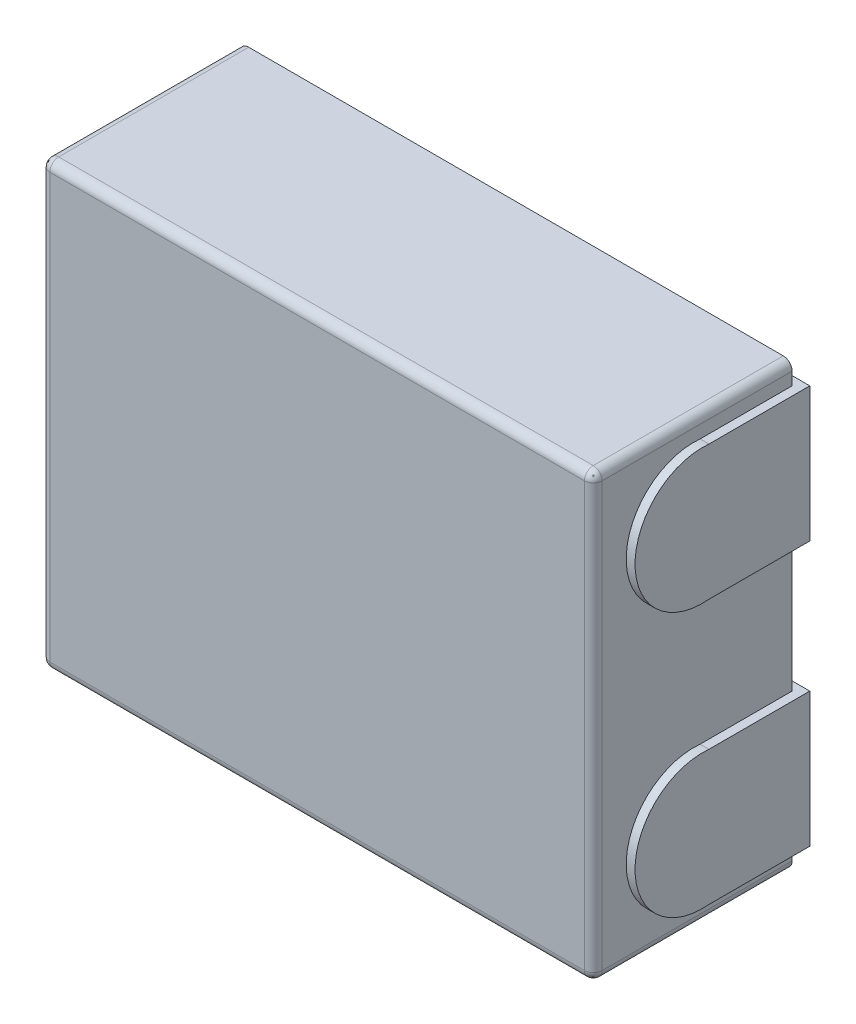
ISO-10303-21;
HEADER;
FILE_DESCRIPTION(('STEP AP214'),'2;1');
FILE_NAME('part.step','',(''),(''),'','','');
FILE_SCHEMA(('AUTOMOTIVE_DESIGN { 1 0 10303 214 1 1 1 1 }'));
ENDSEC;
DATA;
#1=APPLICATION_CONTEXT('core data for automotive mechanical design processes');
#2=APPLICATION_PROTOCOL_DEFINITION('international standard','automotive_design',2000,#1);
#3=PRODUCT_CONTEXT('',#1,'mechanical');
#4=PRODUCT('Part','Part','',(#3));
#5=PRODUCT_RELATED_PRODUCT_CATEGORY('part','',(#4));
#6=PRODUCT_DEFINITION_FORMATION('','',#4);
#7=PRODUCT_DEFINITION_CONTEXT('part definition',#1,'design');
#8=PRODUCT_DEFINITION('design','',#6,#7);
#9=PRODUCT_DEFINITION_SHAPE('','',#8);
#10=(LENGTH_UNIT() NAMED_UNIT(*) SI_UNIT(.MILLI.,.METRE.));
#11=(NAMED_UNIT(*) PLANE_ANGLE_UNIT() SI_UNIT($,.RADIAN.));
#12=(NAMED_UNIT(*) SI_UNIT($,.STERADIAN.) SOLID_ANGLE_UNIT());
#13=UNCERTAINTY_MEASURE_WITH_UNIT(LENGTH_MEASURE(1.E-05),#10,'distance_accuracy_value','');
#14=(GEOMETRIC_REPRESENTATION_CONTEXT(3) GLOBAL_UNCERTAINTY_ASSIGNED_CONTEXT((#13)) GLOBAL_UNIT_ASSIGNED_CONTEXT((#10,
#11,#12)) REPRESENTATION_CONTEXT('',''));
#15=CARTESIAN_POINT('',(0.,0.,0.));
#16=DIRECTION('',(0.,0.,1.));
#17=DIRECTION('',(1.,0.,0.));
#18=AXIS2_PLACEMENT_3D('',#15,#16,#17);
#19=CARTESIAN_POINT('',(-3.01252459766994,-0.304168853033011,-0.0199999999999996));
#20=DIRECTION('',(0.,0.,1.));
#21=DIRECTION('',(1.,0.,0.));
#22=AXIS2_PLACEMENT_3D('',#19,#20,#21);
#23=PLANE('',#22);
#24=DIRECTION('',(1.,0.,0.));
#25=VECTOR('',#24,1.);
#26=CARTESIAN_POINT('',(-3.01252459766994,-0.304168853033011,-0.0199999999999996));
#27=LINE('',#26,#25);
#28=CARTESIAN_POINT('',(-3.01252459766994,-0.304168853033011,-0.0199999999999996));
#29=VERTEX_POINT('',#28);
#30=CARTESIAN_POINT('',(-3.31252459766994,-0.304168853033011,-0.0199999999999996));
#31=VERTEX_POINT('',#30);
#32=EDGE_CURVE('P0_E54',#29,#31,#27,.F.);
#33=ORIENTED_EDGE('',*,*,#32,.T.);
#34=DIRECTION('',(0.,1.,0.));
#35=VECTOR('',#34,1.);
#36=CARTESIAN_POINT('',(-3.31252459766994,-0.152084426516506,-0.0199999999999997));
#37=LINE('',#36,#35);
#38=CARTESIAN_POINT('',(-3.31252459766994,0.,-0.0199999999999997));
#39=VERTEX_POINT('',#38);
#40=EDGE_CURVE('P0_E64',#39,#31,#37,.F.);
#41=ORIENTED_EDGE('',*,*,#40,.F.);
#42=DIRECTION('',(1.,0.,0.));
#43=VECTOR('',#42,1.);
#44=CARTESIAN_POINT('',(-3.01252459766994,0.,-0.0199999999999997));
#45=LINE('',#44,#43);
#46=CARTESIAN_POINT('',(-3.01252459766994,0.,-0.0199999999999997));
#47=VERTEX_POINT('',#46);
#48=EDGE_CURVE('P0_E61',#39,#47,#45,.T.);
#49=ORIENTED_EDGE('',*,*,#48,.T.);
#50=DIRECTION('',(0.,1.,0.));
#51=VECTOR('',#50,1.);
#52=CARTESIAN_POINT('',(-3.01252459766994,-0.152084426516506,-0.0199999999999996));
#53=LINE('',#52,#51);
#54=EDGE_CURVE('P0_E63',#47,#29,#53,.F.);
#55=ORIENTED_EDGE('',*,*,#54,.T.);
#56=EDGE_LOOP('',(#33,#41,#49,#55));
#57=FACE_BOUND('',#56,.T.);
#58=ADVANCED_FACE('P0_F16',(#57),#23,.F.);
#59=CARTESIAN_POINT('',(-3.01252459766994,-0.152084426516506,0.137210257429789));
#60=DIRECTION('',(-1.,0.,0.));
#61=DIRECTION('',(0.,0.,1.));
#62=AXIS2_PLACEMENT_3D('',#59,#60,#61);
#63=PLANE('',#62);
#64=DIRECTION('',(0.,0.,-1.));
#65=VECTOR('',#64,1.);
#66=CARTESIAN_POINT('',(-3.01252459766994,0.,-0.0199999999999996));
#67=LINE('',#66,#65);
#68=CARTESIAN_POINT('',(-3.01252459766994,0.,0.208056510436575));
#69=VERTEX_POINT('',#68);
#70=EDGE_CURVE('P0_E68',#47,#69,#67,.F.);
#71=ORIENTED_EDGE('',*,*,#70,.T.);
#72=CARTESIAN_POINT('',(-3.01252459766994,-0.152084426516506,0.222703998621652));
#73=DIRECTION('',(1.,0.,0.));
#74=DIRECTION('',(0.,0.,-1.));
#75=AXIS2_PLACEMENT_3D('',#72,#73,#74);
#76=CIRCLE('',#75,0.152788159551015);
#77=CARTESIAN_POINT('',(-3.01252459766994,-0.304168853033011,0.208056510436569));
#78=VERTEX_POINT('',#77);
#79=EDGE_CURVE('P0_E19',#78,#69,#76,.F.);
#80=ORIENTED_EDGE('',*,*,#79,.F.);
#81=DIRECTION('',(0.,0.,1.));
#82=VECTOR('',#81,1.);
#83=CARTESIAN_POINT('',(-3.01252459766994,-0.304168853033011,0.208056510436572));
#84=LINE('',#83,#82);
#85=EDGE_CURVE('P0_E72',#78,#29,#84,.F.);
#86=ORIENTED_EDGE('',*,*,#85,.T.);
#87=ORIENTED_EDGE('',*,*,#54,.F.);
#88=EDGE_LOOP('',(#71,#80,#86,#87));
#89=FACE_BOUND('',#88,.T.);
#90=ADVANCED_FACE('P0_F70',(#89),#63,.F.);
#91=CARTESIAN_POINT('',(-3.01252459766994,0.,-0.0199999999999996));
#92=DIRECTION('',(0.,-1.,0.));
#93=DIRECTION('',(0.,0.,-1.));
#94=AXIS2_PLACEMENT_3D('',#91,#92,#93);
#95=PLANE('',#94);
#96=ORIENTED_EDGE('',*,*,#48,.F.);
#97=DIRECTION('',(0.,0.,1.));
#98=VECTOR('',#97,1.);
#99=CARTESIAN_POINT('',(-3.31252459766994,0.,0.137210257429789));
#100=LINE('',#99,#98);
#101=CARTESIAN_POINT('',(-3.31252459766994,0.,0.208056510436575));
#102=VERTEX_POINT('',#101);
#103=EDGE_CURVE('P0_E78',#102,#39,#100,.F.);
#104=ORIENTED_EDGE('',*,*,#103,.F.);
#105=DIRECTION('',(1.,0.,0.));
#106=VECTOR('',#105,1.);
#107=CARTESIAN_POINT('',(-3.01252459766994,0.,0.208056510436572));
#108=LINE('',#107,#106);
#109=EDGE_CURVE('P0_E76',#69,#102,#108,.F.);
#110=ORIENTED_EDGE('',*,*,#109,.F.);
#111=ORIENTED_EDGE('',*,*,#70,.F.);
#112=EDGE_LOOP('',(#96,#104,#110,#111));
#113=FACE_BOUND('',#112,.T.);
#114=ADVANCED_FACE('P0_F74',(#113),#95,.F.);
#115=CARTESIAN_POINT('',(-3.31252459766994,-0.152084426516506,0.137210257429789));
#116=DIRECTION('',(-1.,0.,0.));
#117=DIRECTION('',(0.,0.,1.));
#118=AXIS2_PLACEMENT_3D('',#115,#116,#117);
#119=PLANE('',#118);
#120=CARTESIAN_POINT('',(-3.31252459766994,-0.152084426516506,0.222703998621652));
#121=DIRECTION('',(1.,0.,0.));
#122=DIRECTION('',(0.,0.,-1.));
#123=AXIS2_PLACEMENT_3D('',#120,#121,#122);
#124=CIRCLE('',#123,0.152788159551015);
#125=CARTESIAN_POINT('',(-3.31252459766994,-0.304168853033011,0.208056510436569));
#126=VERTEX_POINT('',#125);
#127=EDGE_CURVE('P0_E25',#102,#126,#124,.T.);
#128=ORIENTED_EDGE('',*,*,#127,.F.);
#129=ORIENTED_EDGE('',*,*,#103,.T.);
#130=ORIENTED_EDGE('',*,*,#40,.T.);
#131=DIRECTION('',(0.,0.,1.));
#132=VECTOR('',#131,1.);
#133=CARTESIAN_POINT('',(-3.31252459766994,-0.304168853033011,0.208056510436572));
#134=LINE('',#133,#132);
#135=EDGE_CURVE('P0_E34',#31,#126,#134,.T.);
#136=ORIENTED_EDGE('',*,*,#135,.T.);
#137=EDGE_LOOP('',(#128,#129,#130,#136));
#138=FACE_BOUND('',#137,.T.);
#139=ADVANCED_FACE('P0_F103',(#138),#119,.T.);
#140=CARTESIAN_POINT('',(-3.01252459766994,-0.304168853033011,0.208056510436572));
#141=DIRECTION('',(0.,1.,0.));
#142=DIRECTION('',(0.,0.,1.));
#143=AXIS2_PLACEMENT_3D('',#140,#141,#142);
#144=PLANE('',#143);
#145=DIRECTION('',(1.,0.,0.));
#146=VECTOR('',#145,1.);
#147=CARTESIAN_POINT('',(-3.01252459766994,-0.304168853033011,0.208056510436572));
#148=LINE('',#147,#146);
#149=EDGE_CURVE('P0_E11',#126,#78,#148,.T.);
#150=ORIENTED_EDGE('',*,*,#149,.F.);
#151=ORIENTED_EDGE('',*,*,#135,.F.);
#152=ORIENTED_EDGE('',*,*,#32,.F.);
#153=ORIENTED_EDGE('',*,*,#85,.F.);
#154=EDGE_LOOP('',(#150,#151,#152,#153));
#155=FACE_BOUND('',#154,.T.);
#156=ADVANCED_FACE('P0_F105',(#155),#144,.F.);
#157=CARTESIAN_POINT('',(-3.01252459766994,-0.152084426516506,0.222703998621652));
#158=DIRECTION('',(1.,0.,0.));
#159=DIRECTION('',(0.,0.,-1.));
#160=AXIS2_PLACEMENT_3D('',#157,#158,#159);
#161=CYLINDRICAL_SURFACE('',#160,0.152788159551015);
#162=ORIENTED_EDGE('',*,*,#127,.T.);
#163=ORIENTED_EDGE('',*,*,#149,.T.);
#164=ORIENTED_EDGE('',*,*,#79,.T.);
#165=ORIENTED_EDGE('',*,*,#109,.T.);
#166=EDGE_LOOP('',(#162,#163,#164,#165));
#167=FACE_BOUND('',#166,.T.);
#168=ADVANCED_FACE('P0_F106',(#167),#161,.T.);
#169=CLOSED_SHELL('',(#58,#90,#114,#139,#156,#168));
#170=MANIFOLD_SOLID_BREP('P0_B1',#169);
#171=CARTESIAN_POINT('',(-3.01252459766994,-0.902482697205198,-0.0199999999999996));
#172=DIRECTION('',(0.,0.,1.));
#173=DIRECTION('',(1.,0.,0.));
#174=AXIS2_PLACEMENT_3D('',#171,#172,#173);
#175=PLANE('',#174);
#176=DIRECTION('',(1.,0.,0.));
#177=VECTOR('',#176,1.);
#178=CARTESIAN_POINT('',(-3.01252459766994,-0.902482697205198,-0.0199999999999996));
#179=LINE('',#178,#177);
#180=CARTESIAN_POINT('',(-3.01252459766994,-0.902482697205198,-0.0199999999999996));
#181=VERTEX_POINT('',#180);
#182=CARTESIAN_POINT('',(-3.31252459766994,-0.902482697205198,-0.0199999999999996));
#183=VERTEX_POINT('',#182);
#184=EDGE_CURVE('P1_E54',#181,#183,#179,.F.);
#185=ORIENTED_EDGE('',*,*,#184,.T.);
#186=DIRECTION('',(0.,1.,0.));
#187=VECTOR('',#186,1.);
#188=CARTESIAN_POINT('',(-3.31252459766994,-0.750398270688693,-0.0199999999999997));
#189=LINE('',#188,#187);
#190=CARTESIAN_POINT('',(-3.31252459766994,-0.598313844172187,-0.0199999999999997));
#191=VERTEX_POINT('',#190);
#192=EDGE_CURVE('P1_E64',#183,#191,#189,.T.);
#193=ORIENTED_EDGE('',*,*,#192,.T.);
#194=DIRECTION('',(1.,0.,0.));
#195=VECTOR('',#194,1.);
#196=CARTESIAN_POINT('',(-3.01252459766994,-0.598313844172187,-0.0199999999999997));
#197=LINE('',#196,#195);
#198=CARTESIAN_POINT('',(-3.01252459766994,-0.598313844172187,-0.0199999999999997));
#199=VERTEX_POINT('',#198);
#200=EDGE_CURVE('P1_E61',#191,#199,#197,.T.);
#201=ORIENTED_EDGE('',*,*,#200,.T.);
#202=DIRECTION('',(0.,1.,0.));
#203=VECTOR('',#202,1.);
#204=CARTESIAN_POINT('',(-3.01252459766994,-0.750398270688693,-0.0199999999999996));
#205=LINE('',#204,#203);
#206=EDGE_CURVE('P1_E63',#181,#199,#205,.T.);
#207=ORIENTED_EDGE('',*,*,#206,.F.);
#208=EDGE_LOOP('',(#185,#193,#201,#207));
#209=FACE_BOUND('',#208,.T.);
#210=ADVANCED_FACE('P1_F16',(#209),#175,.F.);
#211=CARTESIAN_POINT('',(-3.01252459766994,-0.750398270688693,0.137210257429789));
#212=DIRECTION('',(1.,0.,0.));
#213=DIRECTION('',(0.,0.,-1.));
#214=AXIS2_PLACEMENT_3D('',#211,#212,#213);
#215=PLANE('',#214);
#216=DIRECTION('',(0.,0.,1.));
#217=VECTOR('',#216,1.);
#218=CARTESIAN_POINT('',(-3.01252459766994,-0.902482697205198,0.208056510436572));
#219=LINE('',#218,#217);
#220=CARTESIAN_POINT('',(-3.01252459766994,-0.902482697205198,0.208056510436569));
#221=VERTEX_POINT('',#220);
#222=EDGE_CURVE('P1_E72',#221,#181,#219,.F.);
#223=ORIENTED_EDGE('',*,*,#222,.T.);
#224=ORIENTED_EDGE('',*,*,#206,.T.);
#225=DIRECTION('',(0.,0.,-1.));
#226=VECTOR('',#225,1.);
#227=CARTESIAN_POINT('',(-3.01252459766994,-0.598313844172187,-0.0199999999999996));
#228=LINE('',#227,#226);
#229=CARTESIAN_POINT('',(-3.01252459766994,-0.598313844172187,0.208056510436575));
#230=VERTEX_POINT('',#229);
#231=EDGE_CURVE('P1_E68',#199,#230,#228,.F.);
#232=ORIENTED_EDGE('',*,*,#231,.T.);
#233=CARTESIAN_POINT('',(-3.01252459766994,-0.750398270688693,0.222703998621652));
#234=DIRECTION('',(1.,0.,0.));
#235=DIRECTION('',(0.,0.,-1.));
#236=AXIS2_PLACEMENT_3D('',#233,#234,#235);
#237=CIRCLE('',#236,0.152788159551015);
#238=EDGE_CURVE('P1_E19',#221,#230,#237,.F.);
#239=ORIENTED_EDGE('',*,*,#238,.F.);
#240=EDGE_LOOP('',(#223,#224,#232,#239));
#241=FACE_BOUND('',#240,.T.);
#242=ADVANCED_FACE('P1_F70',(#241),#215,.T.);
#243=CARTESIAN_POINT('',(-3.01252459766994,-0.598313844172187,-0.0199999999999996));
#244=DIRECTION('',(0.,-1.,0.));
#245=DIRECTION('',(0.,0.,-1.));
#246=AXIS2_PLACEMENT_3D('',#243,#244,#245);
#247=PLANE('',#246);
#248=ORIENTED_EDGE('',*,*,#200,.F.);
#249=DIRECTION('',(0.,0.,-1.));
#250=VECTOR('',#249,1.);
#251=CARTESIAN_POINT('',(-3.31252459766994,-0.598313844172187,0.137210257429789));
#252=LINE('',#251,#250);
#253=CARTESIAN_POINT('',(-3.31252459766994,-0.598313844172187,0.208056510436574));
#254=VERTEX_POINT('',#253);
#255=EDGE_CURVE('P1_E78',#191,#254,#252,.F.);
#256=ORIENTED_EDGE('',*,*,#255,.T.);
#257=DIRECTION('',(1.,0.,0.));
#258=VECTOR('',#257,1.);
#259=CARTESIAN_POINT('',(-3.01252459766994,-0.598313844172187,0.208056510436572));
#260=LINE('',#259,#258);
#261=EDGE_CURVE('P1_E76',#230,#254,#260,.F.);
#262=ORIENTED_EDGE('',*,*,#261,.F.);
#263=ORIENTED_EDGE('',*,*,#231,.F.);
#264=EDGE_LOOP('',(#248,#256,#262,#263));
#265=FACE_BOUND('',#264,.T.);
#266=ADVANCED_FACE('P1_F74',(#265),#247,.F.);
#267=CARTESIAN_POINT('',(-3.31252459766994,-0.750398270688693,0.137210257429789));
#268=DIRECTION('',(1.,0.,0.));
#269=DIRECTION('',(0.,0.,-1.));
#270=AXIS2_PLACEMENT_3D('',#267,#268,#269);
#271=PLANE('',#270);
#272=ORIENTED_EDGE('',*,*,#192,.F.);
#273=DIRECTION('',(0.,0.,1.));
#274=VECTOR('',#273,1.);
#275=CARTESIAN_POINT('',(-3.31252459766994,-0.902482697205198,0.208056510436572));
#276=LINE('',#275,#274);
#277=CARTESIAN_POINT('',(-3.31252459766994,-0.902482697205198,0.208056510436569));
#278=VERTEX_POINT('',#277);
#279=EDGE_CURVE('P1_E34',#183,#278,#276,.T.);
#280=ORIENTED_EDGE('',*,*,#279,.T.);
#281=CARTESIAN_POINT('',(-3.31252459766994,-0.750398270688693,0.222703998621652));
#282=DIRECTION('',(1.,0.,0.));
#283=DIRECTION('',(0.,0.,-1.));
#284=AXIS2_PLACEMENT_3D('',#281,#282,#283);
#285=CIRCLE('',#284,0.152788159551015);
#286=EDGE_CURVE('P1_E25',#254,#278,#285,.T.);
#287=ORIENTED_EDGE('',*,*,#286,.F.);
#288=ORIENTED_EDGE('',*,*,#255,.F.);
#289=EDGE_LOOP('',(#272,#280,#287,#288));
#290=FACE_BOUND('',#289,.T.);
#291=ADVANCED_FACE('P1_F103',(#290),#271,.F.);
#292=CARTESIAN_POINT('',(-3.01252459766994,-0.902482697205198,0.208056510436572));
#293=DIRECTION('',(0.,1.,0.));
#294=DIRECTION('',(0.,0.,1.));
#295=AXIS2_PLACEMENT_3D('',#292,#293,#294);
#296=PLANE('',#295);
#297=DIRECTION('',(1.,0.,0.));
#298=VECTOR('',#297,1.);
#299=CARTESIAN_POINT('',(-3.01252459766994,-0.902482697205199,0.208056510436572));
#300=LINE('',#299,#298);
#301=EDGE_CURVE('P1_E11',#278,#221,#300,.T.);
#302=ORIENTED_EDGE('',*,*,#301,.F.);
#303=ORIENTED_EDGE('',*,*,#279,.F.);
#304=ORIENTED_EDGE('',*,*,#184,.F.);
#305=ORIENTED_EDGE('',*,*,#222,.F.);
#306=EDGE_LOOP('',(#302,#303,#304,#305));
#307=FACE_BOUND('',#306,.T.);
#308=ADVANCED_FACE('P1_F105',(#307),#296,.F.);
#309=CARTESIAN_POINT('',(-3.01252459766994,-0.750398270688693,0.222703998621652));
#310=DIRECTION('',(1.,0.,0.));
#311=DIRECTION('',(0.,0.,-1.));
#312=AXIS2_PLACEMENT_3D('',#309,#310,#311);
#313=CYLINDRICAL_SURFACE('',#312,0.152788159551015);
#314=ORIENTED_EDGE('',*,*,#286,.T.);
#315=ORIENTED_EDGE('',*,*,#301,.T.);
#316=ORIENTED_EDGE('',*,*,#238,.T.);
#317=ORIENTED_EDGE('',*,*,#261,.T.);
#318=EDGE_LOOP('',(#314,#315,#316,#317));
#319=FACE_BOUND('',#318,.T.);
#320=ADVANCED_FACE('P1_F112',(#319),#313,.T.);
#321=CLOSED_SHELL('',(#210,#242,#266,#291,#308,#320));
#322=MANIFOLD_SOLID_BREP('P1_B1',#321);
#323=CARTESIAN_POINT('',(-4.30252459766994,-0.304168853033011,-0.0199999999999997));
#324=DIRECTION('',(0.,0.,-1.));
#325=DIRECTION('',(-1.,0.,0.));
#326=AXIS2_PLACEMENT_3D('',#323,#324,#325);
#327=PLANE('',#326);
#328=DIRECTION('',(0.,-1.,0.));
#329=VECTOR('',#328,1.);
#330=CARTESIAN_POINT('',(-4.00252459766994,-0.152084426516506,-0.0199999999999998));
#331=LINE('',#330,#329);
#332=CARTESIAN_POINT('',(-4.00252459766994,0.,-0.0199999999999998));
#333=VERTEX_POINT('',#332);
#334=CARTESIAN_POINT('',(-4.00252459766994,-0.304168853033011,-0.0199999999999998));
#335=VERTEX_POINT('',#334);
#336=EDGE_CURVE('P2_E51',#333,#335,#331,.T.);
#337=ORIENTED_EDGE('',*,*,#336,.T.);
#338=DIRECTION('',(1.,0.,0.));
#339=VECTOR('',#338,1.);
#340=CARTESIAN_POINT('',(-4.30252459766994,-0.304168853033011,-0.0199999999999997));
#341=LINE('',#340,#339);
#342=CARTESIAN_POINT('',(-4.30252459766994,-0.304168853033011,-0.0199999999999997));
#343=VERTEX_POINT('',#342);
#344=EDGE_CURVE('P2_E70',#343,#335,#341,.T.);
#345=ORIENTED_EDGE('',*,*,#344,.F.);
#346=DIRECTION('',(0.,-1.,0.));
#347=VECTOR('',#346,1.);
#348=CARTESIAN_POINT('',(-4.30252459766994,-0.152084426516506,-0.0199999999999997));
#349=LINE('',#348,#347);
#350=CARTESIAN_POINT('',(-4.30252459766994,0.,-0.0199999999999998));
#351=VERTEX_POINT('',#350);
#352=EDGE_CURVE('P2_E60',#351,#343,#349,.T.);
#353=ORIENTED_EDGE('',*,*,#352,.F.);
#354=DIRECTION('',(1.,0.,0.));
#355=VECTOR('',#354,1.);
#356=CARTESIAN_POINT('',(-4.30252459766994,0.,-0.0199999999999998));
#357=LINE('',#356,#355);
#358=EDGE_CURVE('P2_E90',#333,#351,#357,.F.);
#359=ORIENTED_EDGE('',*,*,#358,.F.);
#360=EDGE_LOOP('',(#337,#345,#353,#359));
#361=FACE_BOUND('',#360,.T.);
#362=ADVANCED_FACE('P2_F16',(#361),#327,.T.);
#363=CARTESIAN_POINT('',(-4.30252459766994,-0.152084426516506,0.137210257429789));
#364=DIRECTION('',(-1.,0.,0.));
#365=DIRECTION('',(0.,-1.,0.));
#366=AXIS2_PLACEMENT_3D('',#363,#364,#365);
#367=PLANE('',#366);
#368=CARTESIAN_POINT('',(-4.30252459766994,-0.152084426516506,0.222703998621652));
#369=DIRECTION('',(1.,0.,0.));
#370=DIRECTION('',(0.,0.,-1.));
#371=AXIS2_PLACEMENT_3D('',#368,#369,#370);
#372=CIRCLE('',#371,0.152788159551015);
#373=CARTESIAN_POINT('',(-4.30252459766994,0.,0.208056510436575));
#374=VERTEX_POINT('',#373);
#375=CARTESIAN_POINT('',(-4.30252459766994,-0.304168853033011,0.208056510436569));
#376=VERTEX_POINT('',#375);
#377=EDGE_CURVE('P2_E19',#374,#376,#372,.T.);
#378=ORIENTED_EDGE('',*,*,#377,.F.);
#379=DIRECTION('',(0.,0.,1.));
#380=VECTOR('',#379,1.);
#381=CARTESIAN_POINT('',(-4.30252459766994,0.,-0.0199999999999997));
#382=LINE('',#381,#380);
#383=EDGE_CURVE('P2_E66',#351,#374,#382,.T.);
#384=ORIENTED_EDGE('',*,*,#383,.F.);
#385=ORIENTED_EDGE('',*,*,#352,.T.);
#386=DIRECTION('',(0.,0.,-1.));
#387=VECTOR('',#386,1.);
#388=CARTESIAN_POINT('',(-4.30252459766994,-0.304168853033011,0.208056510436572));
#389=LINE('',#388,#387);
#390=EDGE_CURVE('P2_E64',#376,#343,#389,.T.);
#391=ORIENTED_EDGE('',*,*,#390,.F.);
#392=EDGE_LOOP('',(#378,#384,#385,#391));
#393=FACE_BOUND('',#392,.T.);
#394=ADVANCED_FACE('P2_F62',(#393),#367,.T.);
#395=CARTESIAN_POINT('',(-4.30252459766994,-0.304168853033011,0.208056510436572));
#396=DIRECTION('',(0.,-1.,0.));
#397=DIRECTION('',(0.,0.,-1.));
#398=AXIS2_PLACEMENT_3D('',#395,#396,#397);
#399=PLANE('',#398);
#400=DIRECTION('',(0.,0.,1.));
#401=VECTOR('',#400,1.);
#402=CARTESIAN_POINT('',(-4.00252459766994,-0.304168853033011,0.137210257429789));
#403=LINE('',#402,#401);
#404=CARTESIAN_POINT('',(-4.00252459766994,-0.304168853033011,0.208056510436569));
#405=VERTEX_POINT('',#404);
#406=EDGE_CURVE('P2_E72',#335,#405,#403,.T.);
#407=ORIENTED_EDGE('',*,*,#406,.T.);
#408=DIRECTION('',(1.,0.,0.));
#409=VECTOR('',#408,1.);
#410=CARTESIAN_POINT('',(-4.30252459766994,-0.304168853033011,0.208056510436572));
#411=LINE('',#410,#409);
#412=EDGE_CURVE('P2_E76',#376,#405,#411,.T.);
#413=ORIENTED_EDGE('',*,*,#412,.F.);
#414=ORIENTED_EDGE('',*,*,#390,.T.);
#415=ORIENTED_EDGE('',*,*,#344,.T.);
#416=EDGE_LOOP('',(#407,#413,#414,#415));
#417=FACE_BOUND('',#416,.T.);
#418=ADVANCED_FACE('P2_F74',(#417),#399,.T.);
#419=CARTESIAN_POINT('',(-4.00252459766994,-0.152084426516506,0.137210257429789));
#420=DIRECTION('',(-1.,0.,0.));
#421=DIRECTION('',(0.,-1.,0.));
#422=AXIS2_PLACEMENT_3D('',#419,#420,#421);
#423=PLANE('',#422);
#424=DIRECTION('',(0.,0.,1.));
#425=VECTOR('',#424,1.);
#426=CARTESIAN_POINT('',(-4.00252459766994,0.,-0.0199999999999997));
#427=LINE('',#426,#425);
#428=CARTESIAN_POINT('',(-4.00252459766994,0.,0.208056510436575));
#429=VERTEX_POINT('',#428);
#430=EDGE_CURVE('P2_E34',#429,#333,#427,.F.);
#431=ORIENTED_EDGE('',*,*,#430,.F.);
#432=CARTESIAN_POINT('',(-4.00252459766994,-0.152084426516506,0.222703998621652));
#433=DIRECTION('',(1.,0.,0.));
#434=DIRECTION('',(0.,0.,-1.));
#435=AXIS2_PLACEMENT_3D('',#432,#433,#434);
#436=CIRCLE('',#435,0.152788159551015);
#437=EDGE_CURVE('P2_E25',#405,#429,#436,.F.);
#438=ORIENTED_EDGE('',*,*,#437,.F.);
#439=ORIENTED_EDGE('',*,*,#406,.F.);
#440=ORIENTED_EDGE('',*,*,#336,.F.);
#441=EDGE_LOOP('',(#431,#438,#439,#440));
#442=FACE_BOUND('',#441,.T.);
#443=ADVANCED_FACE('P2_F112',(#442),#423,.F.);
#444=CARTESIAN_POINT('',(-4.30252459766994,0.,-0.0199999999999997));
#445=DIRECTION('',(0.,1.,0.));
#446=DIRECTION('',(0.,0.,1.));
#447=AXIS2_PLACEMENT_3D('',#444,#445,#446);
#448=PLANE('',#447);
#449=ORIENTED_EDGE('',*,*,#430,.T.);
#450=ORIENTED_EDGE('',*,*,#358,.T.);
#451=ORIENTED_EDGE('',*,*,#383,.T.);
#452=DIRECTION('',(1.,0.,0.));
#453=VECTOR('',#452,1.);
#454=CARTESIAN_POINT('',(-4.30252459766994,0.,0.208056510436572));
#455=LINE('',#454,#453);
#456=EDGE_CURVE('P2_E11',#429,#374,#455,.F.);
#457=ORIENTED_EDGE('',*,*,#456,.F.);
#458=EDGE_LOOP('',(#449,#450,#451,#457));
#459=FACE_BOUND('',#458,.T.);
#460=ADVANCED_FACE('P2_F104',(#459),#448,.T.);
#461=CARTESIAN_POINT('',(-4.30252459766994,-0.152084426516506,0.222703998621652));
#462=DIRECTION('',(1.,0.,0.));
#463=DIRECTION('',(0.,0.,-1.));
#464=AXIS2_PLACEMENT_3D('',#461,#462,#463);
#465=CYLINDRICAL_SURFACE('',#464,0.152788159551015);
#466=ORIENTED_EDGE('',*,*,#437,.T.);
#467=ORIENTED_EDGE('',*,*,#456,.T.);
#468=ORIENTED_EDGE('',*,*,#377,.T.);
#469=ORIENTED_EDGE('',*,*,#412,.T.);
#470=EDGE_LOOP('',(#466,#467,#468,#469));
#471=FACE_BOUND('',#470,.T.);
#472=ADVANCED_FACE('P2_F105',(#471),#465,.T.);
#473=CLOSED_SHELL('',(#362,#394,#418,#443,#460,#472));
#474=MANIFOLD_SOLID_BREP('P2_B1',#473);
#475=CARTESIAN_POINT('',(-4.30252459766994,-0.902482697205198,-0.0199999999999997));
#476=DIRECTION('',(0.,0.,-1.));
#477=DIRECTION('',(-1.,0.,0.));
#478=AXIS2_PLACEMENT_3D('',#475,#476,#477);
#479=PLANE('',#478);
#480=DIRECTION('',(0.,1.,0.));
#481=VECTOR('',#480,1.);
#482=CARTESIAN_POINT('',(-4.00252459766994,-0.750398270688693,-0.0199999999999998));
#483=LINE('',#482,#481);
#484=CARTESIAN_POINT('',(-4.00252459766994,-0.902482697205198,-0.0199999999999998));
#485=VERTEX_POINT('',#484);
#486=CARTESIAN_POINT('',(-4.00252459766994,-0.598313844172187,-0.0199999999999998));
#487=VERTEX_POINT('',#486);
#488=EDGE_CURVE('P3_E51',#485,#487,#483,.T.);
#489=ORIENTED_EDGE('',*,*,#488,.F.);
#490=DIRECTION('',(1.,0.,0.));
#491=VECTOR('',#490,1.);
#492=CARTESIAN_POINT('',(-4.30252459766994,-0.902482697205198,-0.0199999999999997));
#493=LINE('',#492,#491);
#494=CARTESIAN_POINT('',(-4.30252459766994,-0.902482697205198,-0.0199999999999997));
#495=VERTEX_POINT('',#494);
#496=EDGE_CURVE('P3_E70',#495,#485,#493,.T.);
#497=ORIENTED_EDGE('',*,*,#496,.F.);
#498=DIRECTION('',(0.,1.,0.));
#499=VECTOR('',#498,1.);
#500=CARTESIAN_POINT('',(-4.30252459766994,-0.750398270688693,-0.0199999999999997));
#501=LINE('',#500,#499);
#502=CARTESIAN_POINT('',(-4.30252459766994,-0.598313844172187,-0.0199999999999998));
#503=VERTEX_POINT('',#502);
#504=EDGE_CURVE('P3_E60',#495,#503,#501,.T.);
#505=ORIENTED_EDGE('',*,*,#504,.T.);
#506=DIRECTION('',(1.,0.,0.));
#507=VECTOR('',#506,1.);
#508=CARTESIAN_POINT('',(-4.30252459766994,-0.598313844172187,-0.0199999999999998));
#509=LINE('',#508,#507);
#510=EDGE_CURVE('P3_E90',#487,#503,#509,.F.);
#511=ORIENTED_EDGE('',*,*,#510,.F.);
#512=EDGE_LOOP('',(#489,#497,#505,#511));
#513=FACE_BOUND('',#512,.T.);
#514=ADVANCED_FACE('P3_F16',(#513),#479,.T.);
#515=CARTESIAN_POINT('',(-4.30252459766994,-0.750398270688693,0.137210257429789));
#516=DIRECTION('',(1.,0.,0.));
#517=DIRECTION('',(0.,0.,-1.));
#518=AXIS2_PLACEMENT_3D('',#515,#516,#517);
#519=PLANE('',#518);
#520=ORIENTED_EDGE('',*,*,#504,.F.);
#521=DIRECTION('',(0.,0.,-1.));
#522=VECTOR('',#521,1.);
#523=CARTESIAN_POINT('',(-4.30252459766994,-0.902482697205198,0.208056510436572));
#524=LINE('',#523,#522);
#525=CARTESIAN_POINT('',(-4.30252459766994,-0.902482697205198,0.208056510436569));
#526=VERTEX_POINT('',#525);
#527=EDGE_CURVE('P3_E64',#526,#495,#524,.T.);
#528=ORIENTED_EDGE('',*,*,#527,.F.);
#529=CARTESIAN_POINT('',(-4.30252459766994,-0.750398270688693,0.222703998621652));
#530=DIRECTION('',(1.,0.,0.));
#531=DIRECTION('',(0.,0.,-1.));
#532=AXIS2_PLACEMENT_3D('',#529,#530,#531);
#533=CIRCLE('',#532,0.152788159551015);
#534=CARTESIAN_POINT('',(-4.30252459766994,-0.598313844172187,0.208056510436575));
#535=VERTEX_POINT('',#534);
#536=EDGE_CURVE('P3_E19',#535,#526,#533,.T.);
#537=ORIENTED_EDGE('',*,*,#536,.F.);
#538=DIRECTION('',(0.,0.,1.));
#539=VECTOR('',#538,1.);
#540=CARTESIAN_POINT('',(-4.30252459766994,-0.598313844172187,-0.0199999999999997));
#541=LINE('',#540,#539);
#542=EDGE_CURVE('P3_E66',#503,#535,#541,.T.);
#543=ORIENTED_EDGE('',*,*,#542,.F.);
#544=EDGE_LOOP('',(#520,#528,#537,#543));
#545=FACE_BOUND('',#544,.T.);
#546=ADVANCED_FACE('P3_F62',(#545),#519,.F.);
#547=CARTESIAN_POINT('',(-4.30252459766994,-0.902482697205198,0.208056510436572));
#548=DIRECTION('',(0.,-1.,0.));
#549=DIRECTION('',(0.,0.,-1.));
#550=AXIS2_PLACEMENT_3D('',#547,#548,#549);
#551=PLANE('',#550);
#552=DIRECTION('',(0.,0.,-1.));
#553=VECTOR('',#552,1.);
#554=CARTESIAN_POINT('',(-4.00252459766994,-0.902482697205198,0.137210257429789));
#555=LINE('',#554,#553);
#556=CARTESIAN_POINT('',(-4.00252459766994,-0.902482697205198,0.208056510436569));
#557=VERTEX_POINT('',#556);
#558=EDGE_CURVE('P3_E72',#557,#485,#555,.T.);
#559=ORIENTED_EDGE('',*,*,#558,.F.);
#560=DIRECTION('',(1.,0.,0.));
#561=VECTOR('',#560,1.);
#562=CARTESIAN_POINT('',(-4.30252459766994,-0.902482697205199,0.208056510436572));
#563=LINE('',#562,#561);
#564=EDGE_CURVE('P3_E76',#526,#557,#563,.T.);
#565=ORIENTED_EDGE('',*,*,#564,.F.);
#566=ORIENTED_EDGE('',*,*,#527,.T.);
#567=ORIENTED_EDGE('',*,*,#496,.T.);
#568=EDGE_LOOP('',(#559,#565,#566,#567));
#569=FACE_BOUND('',#568,.T.);
#570=ADVANCED_FACE('P3_F74',(#569),#551,.T.);
#571=CARTESIAN_POINT('',(-4.00252459766994,-0.750398270688693,0.137210257429789));
#572=DIRECTION('',(1.,0.,0.));
#573=DIRECTION('',(0.,0.,-1.));
#574=AXIS2_PLACEMENT_3D('',#571,#572,#573);
#575=PLANE('',#574);
#576=ORIENTED_EDGE('',*,*,#558,.T.);
#577=ORIENTED_EDGE('',*,*,#488,.T.);
#578=DIRECTION('',(0.,0.,1.));
#579=VECTOR('',#578,1.);
#580=CARTESIAN_POINT('',(-4.00252459766994,-0.598313844172187,-0.0199999999999997));
#581=LINE('',#580,#579);
#582=CARTESIAN_POINT('',(-4.00252459766994,-0.598313844172187,0.208056510436575));
#583=VERTEX_POINT('',#582);
#584=EDGE_CURVE('P3_E34',#583,#487,#581,.F.);
#585=ORIENTED_EDGE('',*,*,#584,.F.);
#586=CARTESIAN_POINT('',(-4.00252459766994,-0.750398270688693,0.222703998621652));
#587=DIRECTION('',(1.,0.,0.));
#588=DIRECTION('',(0.,0.,-1.));
#589=AXIS2_PLACEMENT_3D('',#586,#587,#588);
#590=CIRCLE('',#589,0.152788159551015);
#591=EDGE_CURVE('P3_E25',#557,#583,#590,.F.);
#592=ORIENTED_EDGE('',*,*,#591,.F.);
#593=EDGE_LOOP('',(#576,#577,#585,#592));
#594=FACE_BOUND('',#593,.T.);
#595=ADVANCED_FACE('P3_F112',(#594),#575,.T.);
#596=CARTESIAN_POINT('',(-4.30252459766994,-0.598313844172187,-0.0199999999999997));
#597=DIRECTION('',(0.,1.,0.));
#598=DIRECTION('',(0.,0.,1.));
#599=AXIS2_PLACEMENT_3D('',#596,#597,#598);
#600=PLANE('',#599);
#601=ORIENTED_EDGE('',*,*,#584,.T.);
#602=ORIENTED_EDGE('',*,*,#510,.T.);
#603=ORIENTED_EDGE('',*,*,#542,.T.);
#604=DIRECTION('',(1.,0.,0.));
#605=VECTOR('',#604,1.);
#606=CARTESIAN_POINT('',(-4.30252459766994,-0.598313844172187,0.208056510436572));
#607=LINE('',#606,#605);
#608=EDGE_CURVE('P3_E11',#583,#535,#607,.F.);
#609=ORIENTED_EDGE('',*,*,#608,.F.);
#610=EDGE_LOOP('',(#601,#602,#603,#609));
#611=FACE_BOUND('',#610,.T.);
#612=ADVANCED_FACE('P3_F104',(#611),#600,.T.);
#613=CARTESIAN_POINT('',(-4.30252459766994,-0.750398270688693,0.222703998621652));
#614=DIRECTION('',(1.,0.,0.));
#615=DIRECTION('',(0.,0.,-1.));
#616=AXIS2_PLACEMENT_3D('',#613,#614,#615);
#617=CYLINDRICAL_SURFACE('',#616,0.152788159551015);
#618=ORIENTED_EDGE('',*,*,#591,.T.);
#619=ORIENTED_EDGE('',*,*,#608,.T.);
#620=ORIENTED_EDGE('',*,*,#536,.T.);
#621=ORIENTED_EDGE('',*,*,#564,.T.);
#622=EDGE_LOOP('',(#618,#619,#620,#621));
#623=FACE_BOUND('',#622,.T.);
#624=ADVANCED_FACE('P3_F105',(#623),#617,.T.);
#625=CLOSED_SHELL('',(#514,#546,#570,#595,#612,#624));
#626=MANIFOLD_SOLID_BREP('P3_B1',#625);
#627=CARTESIAN_POINT('',(-3.65752459766994,-0.451241348602599,0.45));
#628=DIRECTION('',(0.,0.,1.));
#629=DIRECTION('',(1.,0.,0.));
#630=AXIS2_PLACEMENT_3D('',#627,#628,#629);
#631=PLANE('',#630);
#632=DIRECTION('',(-1.,0.,0.));
#633=VECTOR('',#632,1.);
#634=CARTESIAN_POINT('',(-3.34502459766994,0.0287586513974009,0.45));
#635=LINE('',#634,#633);
#636=CARTESIAN_POINT('',(-4.26252459766994,0.0287586513974009,0.45));
#637=VERTEX_POINT('',#636);
#638=CARTESIAN_POINT('',(-3.05252459766994,0.0287586513974009,0.45));
#639=VERTEX_POINT('',#638);
#640=EDGE_CURVE('P4_E260',#637,#639,#635,.F.);
#641=ORIENTED_EDGE('',*,*,#640,.F.);
#642=DIRECTION('',(0.,-1.,0.));
#643=VECTOR('',#642,1.);
#644=CARTESIAN_POINT('',(-4.26252459766994,-0.201241348602599,0.45));
#645=LINE('',#644,#643);
#646=CARTESIAN_POINT('',(-4.26252459766994,-0.931241348602599,0.45));
#647=VERTEX_POINT('',#646);
#648=EDGE_CURVE('P4_E258',#647,#637,#645,.F.);
#649=ORIENTED_EDGE('',*,*,#648,.F.);
#650=DIRECTION('',(1.,0.,0.));
#651=VECTOR('',#650,1.);
#652=CARTESIAN_POINT('',(-3.97002459766994,-0.931241348602599,0.45));
#653=LINE('',#652,#651);
#654=CARTESIAN_POINT('',(-3.05252459766994,-0.931241348602599,0.45));
#655=VERTEX_POINT('',#654);
#656=EDGE_CURVE('P4_E253',#655,#647,#653,.F.);
#657=ORIENTED_EDGE('',*,*,#656,.F.);
#658=DIRECTION('',(0.,1.,0.));
#659=VECTOR('',#658,1.);
#660=CARTESIAN_POINT('',(-3.05252459766994,-0.701241348602599,0.45));
#661=LINE('',#660,#659);
#662=EDGE_CURVE('P4_E95',#639,#655,#661,.F.);
#663=ORIENTED_EDGE('',*,*,#662,.F.);
#664=EDGE_LOOP('',(#641,#649,#657,#663));
#665=FACE_BOUND('',#664,.T.);
#666=ADVANCED_FACE('P4_F16',(#665),#631,.T.);
#667=CARTESIAN_POINT('',(-3.05252459766994,-0.701241348602599,0.43));
#668=DIRECTION('',(0.,1.,0.));
#669=DIRECTION('',(0.,0.,1.));
#670=AXIS2_PLACEMENT_3D('',#667,#668,#669);
#671=CYLINDRICAL_SURFACE('',#670,0.02);
#672=CARTESIAN_POINT('',(-3.05252459766994,-0.931241348602599,0.43));
#673=DIRECTION('',(0.,1.,0.));
#674=DIRECTION('',(0.,0.,1.));
#675=AXIS2_PLACEMENT_3D('',#672,#673,#674);
#676=CIRCLE('',#675,0.02);
#677=CARTESIAN_POINT('',(-3.03252459766994,-0.931241348602599,0.43));
#678=VERTEX_POINT('',#677);
#679=EDGE_CURVE('P4_E246',#678,#655,#676,.F.);
#680=ORIENTED_EDGE('',*,*,#679,.F.);
#681=DIRECTION('',(0.,1.,0.));
#682=VECTOR('',#681,1.);
#683=CARTESIAN_POINT('',(-3.03252459766994,-0.951241348602599,0.43));
#684=LINE('',#683,#682);
#685=CARTESIAN_POINT('',(-3.03252459766994,0.0287586513974009,0.43));
#686=VERTEX_POINT('',#685);
#687=EDGE_CURVE('P4_E118',#686,#678,#684,.F.);
#688=ORIENTED_EDGE('',*,*,#687,.F.);
#689=CARTESIAN_POINT('',(-3.05252459766994,0.0287586513974009,0.43));
#690=DIRECTION('',(0.,1.,0.));
#691=DIRECTION('',(0.,0.,1.));
#692=AXIS2_PLACEMENT_3D('',#689,#690,#691);
#693=CIRCLE('',#692,0.02);
#694=EDGE_CURVE('P4_E19',#639,#686,#693,.T.);
#695=ORIENTED_EDGE('',*,*,#694,.F.);
#696=ORIENTED_EDGE('',*,*,#662,.T.);
#697=EDGE_LOOP('',(#680,#688,#695,#696));
#698=FACE_BOUND('',#697,.T.);
#699=ADVANCED_FACE('P4_F104',(#698),#671,.T.);
#700=CARTESIAN_POINT('',(-3.05252459766994,0.0287586513974009,0.43));
#701=DIRECTION('',(0.577350269189631,0.577350269189627,0.57735026918962));
#702=DIRECTION('',(-0.707106781186543,0.,0.707106781186552));
#703=AXIS2_PLACEMENT_3D('',#700,#701,#702);
#704=SPHERICAL_SURFACE('',#703,0.02);
#705=CARTESIAN_POINT('',(-3.04097759228615,0.0403056567811935,0.441547005383792));
#706=VERTEX_POINT('',#705);
#707=VERTEX_LOOP('',#706);
#708=FACE_BOUND('',#707,.T.);
#709=CARTESIAN_POINT('',(-3.05252459766994,0.0287586513974009,0.43));
#710=DIRECTION('',(0.,0.,1.));
#711=DIRECTION('',(1.,0.,0.));
#712=AXIS2_PLACEMENT_3D('',#709,#710,#711);
#713=CIRCLE('',#712,0.02);
#714=CARTESIAN_POINT('',(-3.05252459766994,0.0487586513974009,0.43));
#715=VERTEX_POINT('',#714);
#716=EDGE_CURVE('P4_E110',#715,#686,#713,.F.);
#717=ORIENTED_EDGE('',*,*,#716,.F.);
#718=CARTESIAN_POINT('',(-3.05252459766994,0.0287586513974009,0.43));
#719=DIRECTION('',(-1.,0.,0.));
#720=DIRECTION('',(0.,0.,1.));
#721=AXIS2_PLACEMENT_3D('',#718,#719,#720);
#722=CIRCLE('',#721,0.02);
#723=EDGE_CURVE('P4_E112',#639,#715,#722,.T.);
#724=ORIENTED_EDGE('',*,*,#723,.F.);
#725=ORIENTED_EDGE('',*,*,#694,.T.);
#726=EDGE_LOOP('',(#717,#724,#725));
#727=FACE_BOUND('',#726,.T.);
#728=ADVANCED_FACE('P4_F100',(#708,#727),#704,.T.);
#729=CARTESIAN_POINT('',(-3.34502459766994,0.0287586513974009,0.43));
#730=DIRECTION('',(-1.,0.,0.));
#731=DIRECTION('',(0.,0.,1.));
#732=AXIS2_PLACEMENT_3D('',#729,#730,#731);
#733=CYLINDRICAL_SURFACE('',#732,0.02);
#734=ORIENTED_EDGE('',*,*,#723,.T.);
#735=DIRECTION('',(1.,0.,0.));
#736=VECTOR('',#735,1.);
#737=CARTESIAN_POINT('',(-3.03252459766994,0.0487586513974009,0.43));
#738=LINE('',#737,#736);
#739=CARTESIAN_POINT('',(-4.26252459766994,0.0487586513974009,0.43));
#740=VERTEX_POINT('',#739);
#741=EDGE_CURVE('P4_E123',#740,#715,#738,.T.);
#742=ORIENTED_EDGE('',*,*,#741,.F.);
#743=CARTESIAN_POINT('',(-4.26252459766994,0.0287586513974009,0.43));
#744=DIRECTION('',(-1.,0.,0.));
#745=DIRECTION('',(0.,0.,1.));
#746=AXIS2_PLACEMENT_3D('',#743,#744,#745);
#747=CIRCLE('',#746,0.02);
#748=EDGE_CURVE('P4_E259',#637,#740,#747,.T.);
#749=ORIENTED_EDGE('',*,*,#748,.F.);
#750=ORIENTED_EDGE('',*,*,#640,.T.);
#751=EDGE_LOOP('',(#734,#742,#749,#750));
#752=FACE_BOUND('',#751,.T.);
#753=ADVANCED_FACE('P4_F103',(#752),#733,.T.);
#754=CARTESIAN_POINT('',(-4.26252459766994,0.0287586513974009,0.43));
#755=DIRECTION('',(-0.577350269189624,0.577350269189616,0.577350269189638));
#756=DIRECTION('',(-0.70710678118656,0.,-0.707106781186535));
#757=AXIS2_PLACEMENT_3D('',#754,#755,#756);
#758=SPHERICAL_SURFACE('',#757,0.02);
#759=CARTESIAN_POINT('',(-4.27407160305373,0.0403056567811933,0.441547005383793));
#760=VERTEX_POINT('',#759);
#761=VERTEX_LOOP('',#760);
#762=FACE_BOUND('',#761,.T.);
#763=CARTESIAN_POINT('',(-4.26252459766994,0.0287586513974009,0.43));
#764=DIRECTION('',(0.,0.,1.));
#765=DIRECTION('',(1.,0.,0.));
#766=AXIS2_PLACEMENT_3D('',#763,#764,#765);
#767=CIRCLE('',#766,0.02);
#768=CARTESIAN_POINT('',(-4.28252459766994,0.0287586513974009,0.43));
#769=VERTEX_POINT('',#768);
#770=EDGE_CURVE('P4_E131',#769,#740,#767,.F.);
#771=ORIENTED_EDGE('',*,*,#770,.F.);
#772=CARTESIAN_POINT('',(-4.26252459766994,0.0287586513974009,0.43));
#773=DIRECTION('',(0.,-1.,0.));
#774=DIRECTION('',(0.,0.,-1.));
#775=AXIS2_PLACEMENT_3D('',#772,#773,#774);
#776=CIRCLE('',#775,0.02);
#777=EDGE_CURVE('P4_E256',#637,#769,#776,.T.);
#778=ORIENTED_EDGE('',*,*,#777,.F.);
#779=ORIENTED_EDGE('',*,*,#748,.T.);
#780=EDGE_LOOP('',(#771,#778,#779));
#781=FACE_BOUND('',#780,.T.);
#782=ADVANCED_FACE('P4_F176',(#762,#781),#758,.T.);
#783=CARTESIAN_POINT('',(-4.26252459766994,-0.201241348602599,0.43));
#784=DIRECTION('',(0.,-1.,0.));
#785=DIRECTION('',(0.,0.,-1.));
#786=AXIS2_PLACEMENT_3D('',#783,#784,#785);
#787=CYLINDRICAL_SURFACE('',#786,0.02);
#788=ORIENTED_EDGE('',*,*,#777,.T.);
#789=DIRECTION('',(0.,1.,0.));
#790=VECTOR('',#789,1.);
#791=CARTESIAN_POINT('',(-4.28252459766994,0.0487586513974009,0.43));
#792=LINE('',#791,#790);
#793=CARTESIAN_POINT('',(-4.28252459766994,-0.931241348602599,0.43));
#794=VERTEX_POINT('',#793);
#795=EDGE_CURVE('P4_E170',#794,#769,#792,.T.);
#796=ORIENTED_EDGE('',*,*,#795,.F.);
#797=CARTESIAN_POINT('',(-4.26252459766994,-0.931241348602599,0.43));
#798=DIRECTION('',(0.,-1.,0.));
#799=DIRECTION('',(0.,0.,-1.));
#800=AXIS2_PLACEMENT_3D('',#797,#798,#799);
#801=CIRCLE('',#800,0.02);
#802=EDGE_CURVE('P4_E254',#647,#794,#801,.T.);
#803=ORIENTED_EDGE('',*,*,#802,.F.);
#804=ORIENTED_EDGE('',*,*,#648,.T.);
#805=EDGE_LOOP('',(#788,#796,#803,#804));
#806=FACE_BOUND('',#805,.T.);
#807=ADVANCED_FACE('P4_F166',(#806),#787,.T.);
#808=CARTESIAN_POINT('',(-4.26252459766994,-0.931241348602599,0.43));
#809=DIRECTION('',(-0.577350269189625,-0.577350269189616,0.577350269189637));
#810=DIRECTION('',(-0.707106781186559,0.,-0.707106781186536));
#811=AXIS2_PLACEMENT_3D('',#808,#809,#810);
#812=SPHERICAL_SURFACE('',#811,0.02);
#813=CARTESIAN_POINT('',(-4.27407160305373,-0.942788353986391,0.441547005383793));
#814=VERTEX_POINT('',#813);
#815=VERTEX_LOOP('',#814);
#816=FACE_BOUND('',#815,.T.);
#817=CARTESIAN_POINT('',(-4.26252459766994,-0.931241348602599,0.43));
#818=DIRECTION('',(0.,0.,1.));
#819=DIRECTION('',(1.,0.,0.));
#820=AXIS2_PLACEMENT_3D('',#817,#818,#819);
#821=CIRCLE('',#820,0.02);
#822=CARTESIAN_POINT('',(-4.26252459766994,-0.951241348602599,0.43));
#823=VERTEX_POINT('',#822);
#824=EDGE_CURVE('P4_E240',#823,#794,#821,.F.);
#825=ORIENTED_EDGE('',*,*,#824,.F.);
#826=CARTESIAN_POINT('',(-4.26252459766994,-0.931241348602599,0.43));
#827=DIRECTION('',(1.,0.,0.));
#828=DIRECTION('',(0.,0.,-1.));
#829=AXIS2_PLACEMENT_3D('',#826,#827,#828);
#830=CIRCLE('',#829,0.02);
#831=EDGE_CURVE('P4_E251',#647,#823,#830,.T.);
#832=ORIENTED_EDGE('',*,*,#831,.F.);
#833=ORIENTED_EDGE('',*,*,#802,.T.);
#834=EDGE_LOOP('',(#825,#832,#833));
#835=FACE_BOUND('',#834,.T.);
#836=ADVANCED_FACE('P4_F161',(#816,#835),#812,.T.);
#837=CARTESIAN_POINT('',(-3.97002459766994,-0.931241348602599,0.43));
#838=DIRECTION('',(1.,0.,0.));
#839=DIRECTION('',(0.,0.,-1.));
#840=AXIS2_PLACEMENT_3D('',#837,#838,#839);
#841=CYLINDRICAL_SURFACE('',#840,0.02);
#842=ORIENTED_EDGE('',*,*,#831,.T.);
#843=DIRECTION('',(1.,0.,0.));
#844=VECTOR('',#843,1.);
#845=CARTESIAN_POINT('',(-4.28252459766994,-0.951241348602599,0.43));
#846=LINE('',#845,#844);
#847=CARTESIAN_POINT('',(-3.05252459766994,-0.951241348602599,0.43));
#848=VERTEX_POINT('',#847);
#849=EDGE_CURVE('P4_E142',#848,#823,#846,.F.);
#850=ORIENTED_EDGE('',*,*,#849,.F.);
#851=CARTESIAN_POINT('',(-3.05252459766994,-0.931241348602599,0.43));
#852=DIRECTION('',(1.,0.,0.));
#853=DIRECTION('',(0.,0.,-1.));
#854=AXIS2_PLACEMENT_3D('',#851,#852,#853);
#855=CIRCLE('',#854,0.02);
#856=EDGE_CURVE('P4_E249',#655,#848,#855,.T.);
#857=ORIENTED_EDGE('',*,*,#856,.F.);
#858=ORIENTED_EDGE('',*,*,#656,.T.);
#859=EDGE_LOOP('',(#842,#850,#857,#858));
#860=FACE_BOUND('',#859,.T.);
#861=ADVANCED_FACE('P4_F156',(#860),#841,.T.);
#862=CARTESIAN_POINT('',(-3.05252459766994,-0.931241348602599,0.43));
#863=DIRECTION('',(0.577350269189631,-0.577350269189626,0.57735026918962));
#864=DIRECTION('',(-0.707106781186543,0.,0.707106781186552));
#865=AXIS2_PLACEMENT_3D('',#862,#863,#864);
#866=SPHERICAL_SURFACE('',#865,0.02);
#867=CARTESIAN_POINT('',(-3.04097759228615,-0.942788353986391,0.441547005383792));
#868=VERTEX_POINT('',#867);
#869=VERTEX_LOOP('',#868);
#870=FACE_BOUND('',#869,.T.);
#871=CARTESIAN_POINT('',(-3.05252459766994,-0.931241348602599,0.43));
#872=DIRECTION('',(0.,0.,1.));
#873=DIRECTION('',(1.,0.,0.));
#874=AXIS2_PLACEMENT_3D('',#871,#872,#873);
#875=CIRCLE('',#874,0.02);
#876=EDGE_CURVE('P4_E237',#678,#848,#875,.F.);
#877=ORIENTED_EDGE('',*,*,#876,.F.);
#878=ORIENTED_EDGE('',*,*,#679,.T.);
#879=ORIENTED_EDGE('',*,*,#856,.T.);
#880=EDGE_LOOP('',(#877,#878,#879));
#881=FACE_BOUND('',#880,.T.);
#882=ADVANCED_FACE('P4_F151',(#870,#881),#866,.T.);
#883=CARTESIAN_POINT('',(-3.03252459766994,-0.951241348602599,0.));
#884=DIRECTION('',(1.,0.,0.));
#885=DIRECTION('',(0.,0.,-1.));
#886=AXIS2_PLACEMENT_3D('',#883,#884,#885);
#887=PLANE('',#886);
#888=DIRECTION('',(0.,0.,1.));
#889=VECTOR('',#888,1.);
#890=CARTESIAN_POINT('',(-3.03252459766994,0.0287586513974009,0.));
#891=LINE('',#890,#889);
#892=CARTESIAN_POINT('',(-3.03252459766994,0.0287586513974009,0.));
#893=VERTEX_POINT('',#892);
#894=EDGE_CURVE('P4_E117',#686,#893,#891,.F.);
#895=ORIENTED_EDGE('',*,*,#894,.F.);
#896=ORIENTED_EDGE('',*,*,#687,.T.);
#897=DIRECTION('',(0.,0.,1.));
#898=VECTOR('',#897,1.);
#899=CARTESIAN_POINT('',(-3.03252459766994,-0.931241348602599,0.));
#900=LINE('',#899,#898);
#901=CARTESIAN_POINT('',(-3.03252459766994,-0.931241348602599,0.));
#902=VERTEX_POINT('',#901);
#903=EDGE_CURVE('P4_E239',#902,#678,#900,.T.);
#904=ORIENTED_EDGE('',*,*,#903,.F.);
#905=DIRECTION('',(0.,1.,0.));
#906=VECTOR('',#905,1.);
#907=CARTESIAN_POINT('',(-3.03252459766994,-0.451241348602599,0.));
#908=LINE('',#907,#906);
#909=EDGE_CURVE('P4_E227',#902,#893,#908,.T.);
#910=ORIENTED_EDGE('',*,*,#909,.T.);
#911=EDGE_LOOP('',(#895,#896,#904,#910));
#912=FACE_BOUND('',#911,.T.);
#913=ADVANCED_FACE('P4_F155',(#912),#887,.T.);
#914=CARTESIAN_POINT('',(-3.05252459766994,0.0287586513974009,0.));
#915=DIRECTION('',(0.,0.,1.));
#916=DIRECTION('',(1.,0.,0.));
#917=AXIS2_PLACEMENT_3D('',#914,#915,#916);
#918=CYLINDRICAL_SURFACE('',#917,0.02);
#919=ORIENTED_EDGE('',*,*,#716,.T.);
#920=ORIENTED_EDGE('',*,*,#894,.T.);
#921=CARTESIAN_POINT('',(-3.05252459766994,0.0287586513974009,0.));
#922=DIRECTION('',(0.,0.,1.));
#923=DIRECTION('',(1.,0.,0.));
#924=AXIS2_PLACEMENT_3D('',#921,#922,#923);
#925=CIRCLE('',#924,0.02);
#926=CARTESIAN_POINT('',(-3.05252459766994,0.0487586513974009,0.));
#927=VERTEX_POINT('',#926);
#928=EDGE_CURVE('P4_E136',#893,#927,#925,.T.);
#929=ORIENTED_EDGE('',*,*,#928,.T.);
#930=DIRECTION('',(0.,0.,1.));
#931=VECTOR('',#930,1.);
#932=CARTESIAN_POINT('',(-3.05252459766994,0.0487586513974009,0.));
#933=LINE('',#932,#931);
#934=EDGE_CURVE('P4_E126',#715,#927,#933,.F.);
#935=ORIENTED_EDGE('',*,*,#934,.F.);
#936=EDGE_LOOP('',(#919,#920,#929,#935));
#937=FACE_BOUND('',#936,.T.);
#938=ADVANCED_FACE('P4_F134',(#937),#918,.T.);
#939=CARTESIAN_POINT('',(-3.03252459766994,0.0487586513974009,0.));
#940=DIRECTION('',(0.,1.,0.));
#941=DIRECTION('',(0.,0.,1.));
#942=AXIS2_PLACEMENT_3D('',#939,#940,#941);
#943=PLANE('',#942);
#944=DIRECTION('',(0.,0.,1.));
#945=VECTOR('',#944,1.);
#946=CARTESIAN_POINT('',(-4.26252459766994,0.0487586513974009,0.));
#947=LINE('',#946,#945);
#948=CARTESIAN_POINT('',(-4.26252459766994,0.0487586513974009,0.));
#949=VERTEX_POINT('',#948);
#950=EDGE_CURVE('P4_E128',#740,#949,#947,.F.);
#951=ORIENTED_EDGE('',*,*,#950,.F.);
#952=ORIENTED_EDGE('',*,*,#741,.T.);
#953=ORIENTED_EDGE('',*,*,#934,.T.);
#954=DIRECTION('',(1.,0.,0.));
#955=VECTOR('',#954,1.);
#956=CARTESIAN_POINT('',(-3.65752459766994,0.0487586513974009,0.));
#957=LINE('',#956,#955);
#958=EDGE_CURVE('P4_E229',#927,#949,#957,.F.);
#959=ORIENTED_EDGE('',*,*,#958,.T.);
#960=EDGE_LOOP('',(#951,#952,#953,#959));
#961=FACE_BOUND('',#960,.T.);
#962=ADVANCED_FACE('P4_F124',(#961),#943,.T.);
#963=CARTESIAN_POINT('',(-4.26252459766994,0.0287586513974009,0.));
#964=DIRECTION('',(0.,0.,1.));
#965=DIRECTION('',(1.,0.,0.));
#966=AXIS2_PLACEMENT_3D('',#963,#964,#965);
#967=CYLINDRICAL_SURFACE('',#966,0.02);
#968=ORIENTED_EDGE('',*,*,#770,.T.);
#969=ORIENTED_EDGE('',*,*,#950,.T.);
#970=CARTESIAN_POINT('',(-4.26252459766994,0.0287586513974009,0.));
#971=DIRECTION('',(0.,0.,1.));
#972=DIRECTION('',(1.,0.,0.));
#973=AXIS2_PLACEMENT_3D('',#970,#971,#972);
#974=CIRCLE('',#973,0.02);
#975=CARTESIAN_POINT('',(-4.28252459766994,0.0287586513974009,0.));
#976=VERTEX_POINT('',#975);
#977=EDGE_CURVE('P4_E231',#949,#976,#974,.T.);
#978=ORIENTED_EDGE('',*,*,#977,.T.);
#979=DIRECTION('',(0.,0.,1.));
#980=VECTOR('',#979,1.);
#981=CARTESIAN_POINT('',(-4.28252459766994,0.0287586513974009,0.));
#982=LINE('',#981,#980);
#983=EDGE_CURVE('P4_E243',#769,#976,#982,.F.);
#984=ORIENTED_EDGE('',*,*,#983,.F.);
#985=EDGE_LOOP('',(#968,#969,#978,#984));
#986=FACE_BOUND('',#985,.T.);
#987=ADVANCED_FACE('P4_F210',(#986),#967,.T.);
#988=CARTESIAN_POINT('',(-4.28252459766994,0.0487586513974009,0.));
#989=DIRECTION('',(-1.,0.,0.));
#990=DIRECTION('',(0.,0.,1.));
#991=AXIS2_PLACEMENT_3D('',#988,#989,#990);
#992=PLANE('',#991);
#993=ORIENTED_EDGE('',*,*,#983,.T.);
#994=DIRECTION('',(0.,1.,0.));
#995=VECTOR('',#994,1.);
#996=CARTESIAN_POINT('',(-4.28252459766994,-0.451241348602599,0.));
#997=LINE('',#996,#995);
#998=CARTESIAN_POINT('',(-4.28252459766994,-0.931241348602599,0.));
#999=VERTEX_POINT('',#998);
#1000=EDGE_CURVE('P4_E266',#976,#999,#997,.F.);
#1001=ORIENTED_EDGE('',*,*,#1000,.T.);
#1002=DIRECTION('',(0.,0.,1.));
#1003=VECTOR('',#1002,1.);
#1004=CARTESIAN_POINT('',(-4.28252459766994,-0.931241348602599,0.));
#1005=LINE('',#1004,#1003);
#1006=EDGE_CURVE('P4_E146',#794,#999,#1005,.F.);
#1007=ORIENTED_EDGE('',*,*,#1006,.F.);
#1008=ORIENTED_EDGE('',*,*,#795,.T.);
#1009=EDGE_LOOP('',(#993,#1001,#1007,#1008));
#1010=FACE_BOUND('',#1009,.T.);
#1011=ADVANCED_FACE('P4_F206',(#1010),#992,.T.);
#1012=CARTESIAN_POINT('',(-4.26252459766994,-0.931241348602599,0.));
#1013=DIRECTION('',(0.,0.,1.));
#1014=DIRECTION('',(1.,0.,0.));
#1015=AXIS2_PLACEMENT_3D('',#1012,#1013,#1014);
#1016=CYLINDRICAL_SURFACE('',#1015,0.02);
#1017=ORIENTED_EDGE('',*,*,#824,.T.);
#1018=ORIENTED_EDGE('',*,*,#1006,.T.);
#1019=CARTESIAN_POINT('',(-4.26252459766994,-0.931241348602599,0.));
#1020=DIRECTION('',(0.,0.,1.));
#1021=DIRECTION('',(1.,0.,0.));
#1022=AXIS2_PLACEMENT_3D('',#1019,#1020,#1021);
#1023=CIRCLE('',#1022,0.02);
#1024=CARTESIAN_POINT('',(-4.26252459766994,-0.951241348602599,0.));
#1025=VERTEX_POINT('',#1024);
#1026=EDGE_CURVE('P4_E264',#999,#1025,#1023,.T.);
#1027=ORIENTED_EDGE('',*,*,#1026,.T.);
#1028=DIRECTION('',(0.,0.,-1.));
#1029=VECTOR('',#1028,1.);
#1030=CARTESIAN_POINT('',(-4.26252459766994,-0.951241348602599,0.));
#1031=LINE('',#1030,#1029);
#1032=EDGE_CURVE('P4_E145',#823,#1025,#1031,.T.);
#1033=ORIENTED_EDGE('',*,*,#1032,.F.);
#1034=EDGE_LOOP('',(#1017,#1018,#1027,#1033));
#1035=FACE_BOUND('',#1034,.T.);
#1036=ADVANCED_FACE('P4_F202',(#1035),#1016,.T.);
#1037=CARTESIAN_POINT('',(-4.28252459766994,-0.951241348602599,0.));
#1038=DIRECTION('',(0.,-1.,0.));
#1039=DIRECTION('',(0.,0.,-1.));
#1040=AXIS2_PLACEMENT_3D('',#1037,#1038,#1039);
#1041=PLANE('',#1040);
#1042=ORIENTED_EDGE('',*,*,#1032,.T.);
#1043=DIRECTION('',(1.,0.,0.));
#1044=VECTOR('',#1043,1.);
#1045=CARTESIAN_POINT('',(-3.65752459766994,-0.951241348602599,0.));
#1046=LINE('',#1045,#1044);
#1047=CARTESIAN_POINT('',(-3.05252459766994,-0.951241348602599,0.));
#1048=VERTEX_POINT('',#1047);
#1049=EDGE_CURVE('P4_E25',#1025,#1048,#1046,.T.);
#1050=ORIENTED_EDGE('',*,*,#1049,.T.);
#1051=DIRECTION('',(0.,0.,1.));
#1052=VECTOR('',#1051,1.);
#1053=CARTESIAN_POINT('',(-3.05252459766994,-0.951241348602599,0.));
#1054=LINE('',#1053,#1052);
#1055=EDGE_CURVE('P4_E33',#848,#1048,#1054,.F.);
#1056=ORIENTED_EDGE('',*,*,#1055,.F.);
#1057=ORIENTED_EDGE('',*,*,#849,.T.);
#1058=EDGE_LOOP('',(#1042,#1050,#1056,#1057));
#1059=FACE_BOUND('',#1058,.T.);
#1060=ADVANCED_FACE('P4_F196',(#1059),#1041,.T.);
#1061=CARTESIAN_POINT('',(-3.05252459766994,-0.931241348602599,0.));
#1062=DIRECTION('',(0.,0.,1.));
#1063=DIRECTION('',(1.,0.,0.));
#1064=AXIS2_PLACEMENT_3D('',#1061,#1062,#1063);
#1065=CYLINDRICAL_SURFACE('',#1064,0.02);
#1066=ORIENTED_EDGE('',*,*,#876,.T.);
#1067=ORIENTED_EDGE('',*,*,#1055,.T.);
#1068=CARTESIAN_POINT('',(-3.05252459766994,-0.931241348602599,0.));
#1069=DIRECTION('',(0.,0.,1.));
#1070=DIRECTION('',(1.,0.,0.));
#1071=AXIS2_PLACEMENT_3D('',#1068,#1069,#1070);
#1072=CIRCLE('',#1071,0.02);
#1073=EDGE_CURVE('P4_E11',#1048,#902,#1072,.T.);
#1074=ORIENTED_EDGE('',*,*,#1073,.T.);
#1075=ORIENTED_EDGE('',*,*,#903,.T.);
#1076=EDGE_LOOP('',(#1066,#1067,#1074,#1075));
#1077=FACE_BOUND('',#1076,.T.);
#1078=ADVANCED_FACE('P4_F190',(#1077),#1065,.T.);
#1079=CARTESIAN_POINT('',(-3.65752459766994,-0.451241348602599,0.));
#1080=DIRECTION('',(0.,0.,1.));
#1081=DIRECTION('',(1.,0.,0.));
#1082=AXIS2_PLACEMENT_3D('',#1079,#1080,#1081);
#1083=PLANE('',#1082);
#1084=ORIENTED_EDGE('',*,*,#1049,.F.);
#1085=ORIENTED_EDGE('',*,*,#1026,.F.);
#1086=ORIENTED_EDGE('',*,*,#1000,.F.);
#1087=ORIENTED_EDGE('',*,*,#977,.F.);
#1088=ORIENTED_EDGE('',*,*,#958,.F.);
#1089=ORIENTED_EDGE('',*,*,#928,.F.);
#1090=ORIENTED_EDGE('',*,*,#909,.F.);
#1091=ORIENTED_EDGE('',*,*,#1073,.F.);
#1092=EDGE_LOOP('',(#1084,#1085,#1086,#1087,#1088,#1089,#1090,#1091));
#1093=FACE_BOUND('',#1092,.T.);
#1094=ADVANCED_FACE('P4_F188',(#1093),#1083,.F.);
#1095=CLOSED_SHELL('',(#666,#699,#728,#753,#782,#807,#836,#861,#882,#913,#938,#962,#987,#1011,
#1036,#1060,#1078,#1094));
#1096=MANIFOLD_SOLID_BREP('P4_B1',#1095);
#1097=ADVANCED_BREP_SHAPE_REPRESENTATION('',(#18,#170,#322,#474,#626,#1096),#14);
#1098=SHAPE_DEFINITION_REPRESENTATION(#9,#1097);
ENDSEC;
END-ISO-10303-21;
